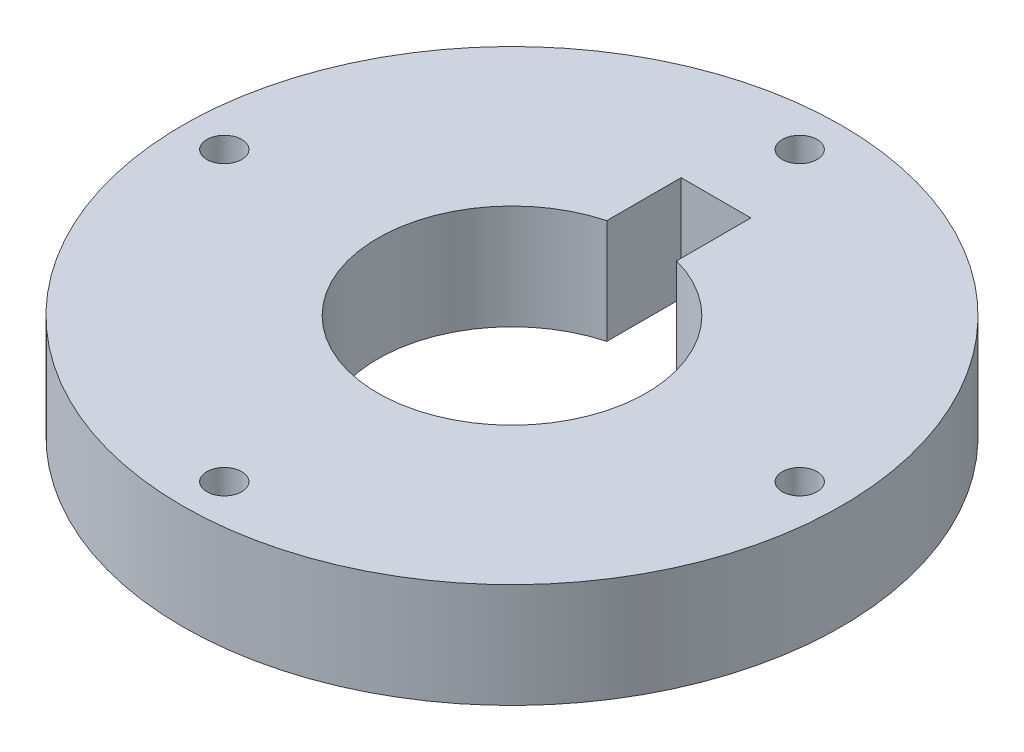
ISO-10303-21;
HEADER;
FILE_DESCRIPTION(('STEP AP214'),'2;1');
FILE_NAME('part.step','',(''),(''),'','','');
FILE_SCHEMA(('AUTOMOTIVE_DESIGN { 1 0 10303 214 1 1 1 1 }'));
ENDSEC;
DATA;
#1=APPLICATION_CONTEXT('core data for automotive mechanical design processes');
#2=APPLICATION_PROTOCOL_DEFINITION('international standard','automotive_design',2000,#1);
#3=PRODUCT_CONTEXT('',#1,'mechanical');
#4=PRODUCT('Part','Part','',(#3));
#5=PRODUCT_RELATED_PRODUCT_CATEGORY('part','',(#4));
#6=PRODUCT_DEFINITION_FORMATION('','',#4);
#7=PRODUCT_DEFINITION_CONTEXT('part definition',#1,'design');
#8=PRODUCT_DEFINITION('design','',#6,#7);
#9=PRODUCT_DEFINITION_SHAPE('','',#8);
#10=(LENGTH_UNIT() NAMED_UNIT(*) SI_UNIT(.MILLI.,.METRE.));
#11=(NAMED_UNIT(*) PLANE_ANGLE_UNIT() SI_UNIT($,.RADIAN.));
#12=(NAMED_UNIT(*) SI_UNIT($,.STERADIAN.) SOLID_ANGLE_UNIT());
#13=UNCERTAINTY_MEASURE_WITH_UNIT(LENGTH_MEASURE(1.E-05),#10,'distance_accuracy_value','');
#14=(GEOMETRIC_REPRESENTATION_CONTEXT(3) GLOBAL_UNCERTAINTY_ASSIGNED_CONTEXT((#13)) GLOBAL_UNIT_ASSIGNED_CONTEXT((#10,
#11,#12)) REPRESENTATION_CONTEXT('',''));
#15=CARTESIAN_POINT('',(0.,0.,0.));
#16=DIRECTION('',(0.,0.,1.));
#17=DIRECTION('',(1.,0.,0.));
#18=AXIS2_PLACEMENT_3D('',#15,#16,#17);
#19=CARTESIAN_POINT('',(0.,15.,0.));
#20=DIRECTION('',(0.,1.,0.));
#21=DIRECTION('',(0.,0.,1.));
#22=AXIS2_PLACEMENT_3D('',#19,#20,#21);
#23=PLANE('',#22);
#24=CARTESIAN_POINT('',(2.33468769191537E-12,15.,41.25));
#25=DIRECTION('',(0.,1.,0.));
#26=DIRECTION('',(0.,0.,1.));
#27=AXIS2_PLACEMENT_3D('',#24,#25,#26);
#28=CIRCLE('',#27,2.50000000000251);
#29=CARTESIAN_POINT('',(2.33468769191537E-12,15.,43.7500000000025));
#30=VERTEX_POINT('',#29);
#31=EDGE_CURVE('E141',#30,#30,#28,.T.);
#32=ORIENTED_EDGE('',*,*,#31,.F.);
#33=EDGE_LOOP('',(#32));
#34=FACE_BOUND('',#33,.T.);
#35=DIRECTION('',(-1.,0.,0.));
#36=VECTOR('',#35,1.);
#37=CARTESIAN_POINT('',(-5.,15.,-29.25));
#38=LINE('',#37,#36);
#39=CARTESIAN_POINT('',(5.,15.,-29.25));
#40=VERTEX_POINT('',#39);
#41=CARTESIAN_POINT('',(-5.,15.,-29.25));
#42=VERTEX_POINT('',#41);
#43=EDGE_CURVE('E83',#40,#42,#38,.T.);
#44=ORIENTED_EDGE('',*,*,#43,.F.);
#45=DIRECTION('',(0.,0.,-1.));
#46=VECTOR('',#45,1.);
#47=CARTESIAN_POINT('',(5.,15.,-18.5893114450213));
#48=LINE('',#47,#46);
#49=CARTESIAN_POINT('',(5.00000000000001,15.,-18.5893114450213));
#50=VERTEX_POINT('',#49);
#51=EDGE_CURVE('E75',#50,#40,#48,.T.);
#52=ORIENTED_EDGE('',*,*,#51,.F.);
#53=CARTESIAN_POINT('',(0.,15.,0.));
#54=DIRECTION('',(0.,1.,0.));
#55=DIRECTION('',(0.,0.,1.));
#56=AXIS2_PLACEMENT_3D('',#53,#54,#55);
#57=CIRCLE('',#56,19.25);
#58=CARTESIAN_POINT('',(-5.,15.,-18.5893114450213));
#59=VERTEX_POINT('',#58);
#60=EDGE_CURVE('E98',#59,#50,#57,.T.);
#61=ORIENTED_EDGE('',*,*,#60,.F.);
#62=DIRECTION('',(0.,0.,1.));
#63=VECTOR('',#62,1.);
#64=CARTESIAN_POINT('',(-5.,15.,-18.5893114450213));
#65=LINE('',#64,#63);
#66=EDGE_CURVE('E96',#42,#59,#65,.T.);
#67=ORIENTED_EDGE('',*,*,#66,.F.);
#68=EDGE_LOOP('',(#44,#52,#61,#67));
#69=FACE_BOUND('',#68,.T.);
#70=CARTESIAN_POINT('',(0.,15.,-41.25));
#71=DIRECTION('',(0.,1.,0.));
#72=DIRECTION('',(0.,0.,1.));
#73=AXIS2_PLACEMENT_3D('',#70,#71,#72);
#74=CIRCLE('',#73,2.5);
#75=CARTESIAN_POINT('',(0.,15.,-38.75));
#76=VERTEX_POINT('',#75);
#77=EDGE_CURVE('E114',#76,#76,#74,.T.);
#78=ORIENTED_EDGE('',*,*,#77,.F.);
#79=EDGE_LOOP('',(#78));
#80=FACE_BOUND('',#79,.T.);
#81=CARTESIAN_POINT('',(0.,15.,0.));
#82=DIRECTION('',(0.,1.,0.));
#83=DIRECTION('',(0.,0.,1.));
#84=AXIS2_PLACEMENT_3D('',#81,#82,#83);
#85=CIRCLE('',#84,47.25);
#86=CARTESIAN_POINT('',(0.,15.,47.25));
#87=VERTEX_POINT('',#86);
#88=EDGE_CURVE('E11',#87,#87,#85,.T.);
#89=ORIENTED_EDGE('',*,*,#88,.T.);
#90=EDGE_LOOP('',(#89));
#91=FACE_BOUND('',#90,.T.);
#92=CARTESIAN_POINT('',(41.2500000000012,15.,-1.16734384595768E-12));
#93=DIRECTION('',(0.,1.,0.));
#94=DIRECTION('',(0.,0.,1.));
#95=AXIS2_PLACEMENT_3D('',#92,#93,#94);
#96=CIRCLE('',#95,2.50000000000091);
#97=CARTESIAN_POINT('',(41.2500000000012,15.,2.49999999999975));
#98=VERTEX_POINT('',#97);
#99=EDGE_CURVE('E104',#98,#98,#96,.T.);
#100=ORIENTED_EDGE('',*,*,#99,.F.);
#101=EDGE_LOOP('',(#100));
#102=FACE_BOUND('',#101,.T.);
#103=CARTESIAN_POINT('',(-41.2499999999988,15.,1.17239551400417E-12));
#104=DIRECTION('',(0.,1.,0.));
#105=DIRECTION('',(0.,0.,1.));
#106=AXIS2_PLACEMENT_3D('',#103,#104,#105);
#107=CIRCLE('',#106,2.50000000000187);
#108=CARTESIAN_POINT('',(-41.2499999999988,15.,2.50000000000305));
#109=VERTEX_POINT('',#108);
#110=EDGE_CURVE('E148',#109,#109,#107,.T.);
#111=ORIENTED_EDGE('',*,*,#110,.F.);
#112=EDGE_LOOP('',(#111));
#113=FACE_BOUND('',#112,.T.);
#114=ADVANCED_FACE('F34',(#34,#69,#80,#91,#102,#113),#23,.T.);
#115=CARTESIAN_POINT('',(0.,0.,0.));
#116=DIRECTION('',(0.,1.,0.));
#117=DIRECTION('',(0.,0.,1.));
#118=AXIS2_PLACEMENT_3D('',#115,#116,#117);
#119=PLANE('',#118);
#120=CARTESIAN_POINT('',(0.,0.,-41.25));
#121=DIRECTION('',(0.,1.,0.));
#122=DIRECTION('',(0.,0.,1.));
#123=AXIS2_PLACEMENT_3D('',#120,#121,#122);
#124=CIRCLE('',#123,2.5);
#125=CARTESIAN_POINT('',(0.,0.,-38.75));
#126=VERTEX_POINT('',#125);
#127=EDGE_CURVE('E91',#126,#126,#124,.T.);
#128=ORIENTED_EDGE('',*,*,#127,.T.);
#129=EDGE_LOOP('',(#128));
#130=FACE_BOUND('',#129,.T.);
#131=CARTESIAN_POINT('',(0.,0.,0.));
#132=DIRECTION('',(0.,1.,0.));
#133=DIRECTION('',(0.,0.,1.));
#134=AXIS2_PLACEMENT_3D('',#131,#132,#133);
#135=CIRCLE('',#134,47.25);
#136=CARTESIAN_POINT('',(0.,0.,47.25));
#137=VERTEX_POINT('',#136);
#138=EDGE_CURVE('E38',#137,#137,#135,.T.);
#139=ORIENTED_EDGE('',*,*,#138,.F.);
#140=EDGE_LOOP('',(#139));
#141=FACE_BOUND('',#140,.T.);
#142=DIRECTION('',(0.,0.,-1.));
#143=VECTOR('',#142,1.);
#144=CARTESIAN_POINT('',(5.,0.,-18.5893114450213));
#145=LINE('',#144,#143);
#146=CARTESIAN_POINT('',(5.00000000000001,0.,-18.5893114450213));
#147=VERTEX_POINT('',#146);
#148=CARTESIAN_POINT('',(5.,0.,-29.25));
#149=VERTEX_POINT('',#148);
#150=EDGE_CURVE('E57',#147,#149,#145,.T.);
#151=ORIENTED_EDGE('',*,*,#150,.T.);
#152=DIRECTION('',(-1.,0.,0.));
#153=VECTOR('',#152,1.);
#154=CARTESIAN_POINT('',(-5.,0.,-29.25));
#155=LINE('',#154,#153);
#156=CARTESIAN_POINT('',(-5.,0.,-29.25));
#157=VERTEX_POINT('',#156);
#158=EDGE_CURVE('E90',#149,#157,#155,.T.);
#159=ORIENTED_EDGE('',*,*,#158,.T.);
#160=DIRECTION('',(0.,0.,1.));
#161=VECTOR('',#160,1.);
#162=CARTESIAN_POINT('',(-5.,0.,-18.5893114450213));
#163=LINE('',#162,#161);
#164=CARTESIAN_POINT('',(-5.,0.,-18.5893114450213));
#165=VERTEX_POINT('',#164);
#166=EDGE_CURVE('E106',#157,#165,#163,.T.);
#167=ORIENTED_EDGE('',*,*,#166,.T.);
#168=CARTESIAN_POINT('',(0.,0.,0.));
#169=DIRECTION('',(0.,1.,0.));
#170=DIRECTION('',(0.,0.,1.));
#171=AXIS2_PLACEMENT_3D('',#168,#169,#170);
#172=CIRCLE('',#171,19.25);
#173=EDGE_CURVE('E84',#165,#147,#172,.T.);
#174=ORIENTED_EDGE('',*,*,#173,.T.);
#175=EDGE_LOOP('',(#151,#159,#167,#174));
#176=FACE_BOUND('',#175,.T.);
#177=CARTESIAN_POINT('',(41.2500000000012,0.,-1.16734384595768E-12));
#178=DIRECTION('',(0.,1.,0.));
#179=DIRECTION('',(0.,0.,1.));
#180=AXIS2_PLACEMENT_3D('',#177,#178,#179);
#181=CIRCLE('',#180,2.50000000000091);
#182=CARTESIAN_POINT('',(41.2500000000012,0.,2.49999999999975));
#183=VERTEX_POINT('',#182);
#184=EDGE_CURVE('E143',#183,#183,#181,.T.);
#185=ORIENTED_EDGE('',*,*,#184,.T.);
#186=EDGE_LOOP('',(#185));
#187=FACE_BOUND('',#186,.T.);
#188=CARTESIAN_POINT('',(2.33468769191537E-12,0.,41.25));
#189=DIRECTION('',(0.,1.,0.));
#190=DIRECTION('',(0.,0.,1.));
#191=AXIS2_PLACEMENT_3D('',#188,#189,#190);
#192=CIRCLE('',#191,2.50000000000251);
#193=CARTESIAN_POINT('',(2.33468769191537E-12,0.,43.7500000000025));
#194=VERTEX_POINT('',#193);
#195=EDGE_CURVE('E144',#194,#194,#192,.T.);
#196=ORIENTED_EDGE('',*,*,#195,.T.);
#197=EDGE_LOOP('',(#196));
#198=FACE_BOUND('',#197,.T.);
#199=CARTESIAN_POINT('',(-41.2499999999988,0.,1.17239551400417E-12));
#200=DIRECTION('',(0.,1.,0.));
#201=DIRECTION('',(0.,0.,1.));
#202=AXIS2_PLACEMENT_3D('',#199,#200,#201);
#203=CIRCLE('',#202,2.50000000000187);
#204=CARTESIAN_POINT('',(-41.2499999999988,0.,2.50000000000305));
#205=VERTEX_POINT('',#204);
#206=EDGE_CURVE('E151',#205,#205,#203,.T.);
#207=ORIENTED_EDGE('',*,*,#206,.T.);
#208=EDGE_LOOP('',(#207));
#209=FACE_BOUND('',#208,.T.);
#210=ADVANCED_FACE('F120',(#130,#141,#176,#187,#198,#209),#119,.F.);
#211=CARTESIAN_POINT('',(0.,15.,0.));
#212=DIRECTION('',(0.,-1.,0.));
#213=DIRECTION('',(0.,0.,-1.));
#214=AXIS2_PLACEMENT_3D('',#211,#212,#213);
#215=CYLINDRICAL_SURFACE('',#214,47.25);
#216=ORIENTED_EDGE('',*,*,#88,.F.);
#217=EDGE_LOOP('',(#216));
#218=FACE_BOUND('',#217,.T.);
#219=ORIENTED_EDGE('',*,*,#138,.T.);
#220=EDGE_LOOP('',(#219));
#221=FACE_BOUND('',#220,.T.);
#222=ADVANCED_FACE('F36',(#218,#221),#215,.T.);
#223=CARTESIAN_POINT('',(0.,15.,-41.25));
#224=DIRECTION('',(0.,-1.,0.));
#225=DIRECTION('',(0.,0.,-1.));
#226=AXIS2_PLACEMENT_3D('',#223,#224,#225);
#227=CYLINDRICAL_SURFACE('',#226,2.5);
#228=ORIENTED_EDGE('',*,*,#77,.T.);
#229=EDGE_LOOP('',(#228));
#230=FACE_BOUND('',#229,.T.);
#231=ORIENTED_EDGE('',*,*,#127,.F.);
#232=EDGE_LOOP('',(#231));
#233=FACE_BOUND('',#232,.T.);
#234=ADVANCED_FACE('F123',(#230,#233),#227,.F.);
#235=CARTESIAN_POINT('',(5.,15.,-18.5893114450213));
#236=DIRECTION('',(-1.,0.,0.));
#237=DIRECTION('',(0.,0.,1.));
#238=AXIS2_PLACEMENT_3D('',#235,#236,#237);
#239=PLANE('',#238);
#240=ORIENTED_EDGE('',*,*,#150,.F.);
#241=DIRECTION('',(0.,-1.,0.));
#242=VECTOR('',#241,1.);
#243=CARTESIAN_POINT('',(5.00000000000001,15.,-18.5893114450213));
#244=LINE('',#243,#242);
#245=EDGE_CURVE('E79',#50,#147,#244,.T.);
#246=ORIENTED_EDGE('',*,*,#245,.F.);
#247=ORIENTED_EDGE('',*,*,#51,.T.);
#248=DIRECTION('',(0.,-1.,0.));
#249=VECTOR('',#248,1.);
#250=CARTESIAN_POINT('',(5.,15.,-29.25));
#251=LINE('',#250,#249);
#252=EDGE_CURVE('E78',#40,#149,#251,.T.);
#253=ORIENTED_EDGE('',*,*,#252,.T.);
#254=EDGE_LOOP('',(#240,#246,#247,#253));
#255=FACE_BOUND('',#254,.T.);
#256=ADVANCED_FACE('F77',(#255),#239,.T.);
#257=CARTESIAN_POINT('',(-5.,15.,-29.25));
#258=DIRECTION('',(0.,0.,1.));
#259=DIRECTION('',(1.,0.,0.));
#260=AXIS2_PLACEMENT_3D('',#257,#258,#259);
#261=PLANE('',#260);
#262=ORIENTED_EDGE('',*,*,#158,.F.);
#263=ORIENTED_EDGE('',*,*,#252,.F.);
#264=ORIENTED_EDGE('',*,*,#43,.T.);
#265=DIRECTION('',(0.,-1.,0.));
#266=VECTOR('',#265,1.);
#267=CARTESIAN_POINT('',(-5.,15.,-29.25));
#268=LINE('',#267,#266);
#269=EDGE_CURVE('E92',#42,#157,#268,.T.);
#270=ORIENTED_EDGE('',*,*,#269,.T.);
#271=EDGE_LOOP('',(#262,#263,#264,#270));
#272=FACE_BOUND('',#271,.T.);
#273=ADVANCED_FACE('F87',(#272),#261,.T.);
#274=CARTESIAN_POINT('',(-5.,15.,-18.5893114450213));
#275=DIRECTION('',(1.,0.,0.));
#276=DIRECTION('',(0.,0.,-1.));
#277=AXIS2_PLACEMENT_3D('',#274,#275,#276);
#278=PLANE('',#277);
#279=ORIENTED_EDGE('',*,*,#166,.F.);
#280=ORIENTED_EDGE('',*,*,#269,.F.);
#281=ORIENTED_EDGE('',*,*,#66,.T.);
#282=DIRECTION('',(0.,-1.,0.));
#283=VECTOR('',#282,1.);
#284=CARTESIAN_POINT('',(-5.,15.,-18.5893114450213));
#285=LINE('',#284,#283);
#286=EDGE_CURVE('E49',#59,#165,#285,.T.);
#287=ORIENTED_EDGE('',*,*,#286,.T.);
#288=EDGE_LOOP('',(#279,#280,#281,#287));
#289=FACE_BOUND('',#288,.T.);
#290=ADVANCED_FACE('F182',(#289),#278,.T.);
#291=CARTESIAN_POINT('',(0.,15.,0.));
#292=DIRECTION('',(0.,-1.,0.));
#293=DIRECTION('',(0.,0.,-1.));
#294=AXIS2_PLACEMENT_3D('',#291,#292,#293);
#295=CYLINDRICAL_SURFACE('',#294,19.25);
#296=ORIENTED_EDGE('',*,*,#173,.F.);
#297=ORIENTED_EDGE('',*,*,#286,.F.);
#298=ORIENTED_EDGE('',*,*,#60,.T.);
#299=ORIENTED_EDGE('',*,*,#245,.T.);
#300=EDGE_LOOP('',(#296,#297,#298,#299));
#301=FACE_BOUND('',#300,.T.);
#302=ADVANCED_FACE('F179',(#301),#295,.F.);
#303=CARTESIAN_POINT('',(41.2500000000012,15.,-1.16734384595768E-12));
#304=DIRECTION('',(0.,-1.,0.));
#305=DIRECTION('',(0.,0.,-1.));
#306=AXIS2_PLACEMENT_3D('',#303,#304,#305);
#307=CYLINDRICAL_SURFACE('',#306,2.50000000000091);
#308=ORIENTED_EDGE('',*,*,#99,.T.);
#309=EDGE_LOOP('',(#308));
#310=FACE_BOUND('',#309,.T.);
#311=ORIENTED_EDGE('',*,*,#184,.F.);
#312=EDGE_LOOP('',(#311));
#313=FACE_BOUND('',#312,.T.);
#314=ADVANCED_FACE('F157',(#310,#313),#307,.F.);
#315=CARTESIAN_POINT('',(2.33468769191537E-12,15.,41.25));
#316=DIRECTION('',(0.,-1.,0.));
#317=DIRECTION('',(0.,0.,-1.));
#318=AXIS2_PLACEMENT_3D('',#315,#316,#317);
#319=CYLINDRICAL_SURFACE('',#318,2.50000000000251);
#320=ORIENTED_EDGE('',*,*,#31,.T.);
#321=EDGE_LOOP('',(#320));
#322=FACE_BOUND('',#321,.T.);
#323=ORIENTED_EDGE('',*,*,#195,.F.);
#324=EDGE_LOOP('',(#323));
#325=FACE_BOUND('',#324,.T.);
#326=ADVANCED_FACE('F170',(#322,#325),#319,.F.);
#327=CARTESIAN_POINT('',(-41.2499999999988,15.,1.17239551400417E-12));
#328=DIRECTION('',(0.,-1.,0.));
#329=DIRECTION('',(0.,0.,-1.));
#330=AXIS2_PLACEMENT_3D('',#327,#328,#329);
#331=CYLINDRICAL_SURFACE('',#330,2.50000000000187);
#332=ORIENTED_EDGE('',*,*,#110,.T.);
#333=EDGE_LOOP('',(#332));
#334=FACE_BOUND('',#333,.T.);
#335=ORIENTED_EDGE('',*,*,#206,.F.);
#336=EDGE_LOOP('',(#335));
#337=FACE_BOUND('',#336,.T.);
#338=ADVANCED_FACE('F168',(#334,#337),#331,.F.);
#339=CLOSED_SHELL('',(#114,#210,#222,#234,#256,#273,#290,#302,#314,#326,#338));
#340=MANIFOLD_SOLID_BREP('B2',#339);
#341=ADVANCED_BREP_SHAPE_REPRESENTATION('',(#18,#340),#14);
#342=SHAPE_DEFINITION_REPRESENTATION(#9,#341);
ENDSEC;
END-ISO-10303-21;
